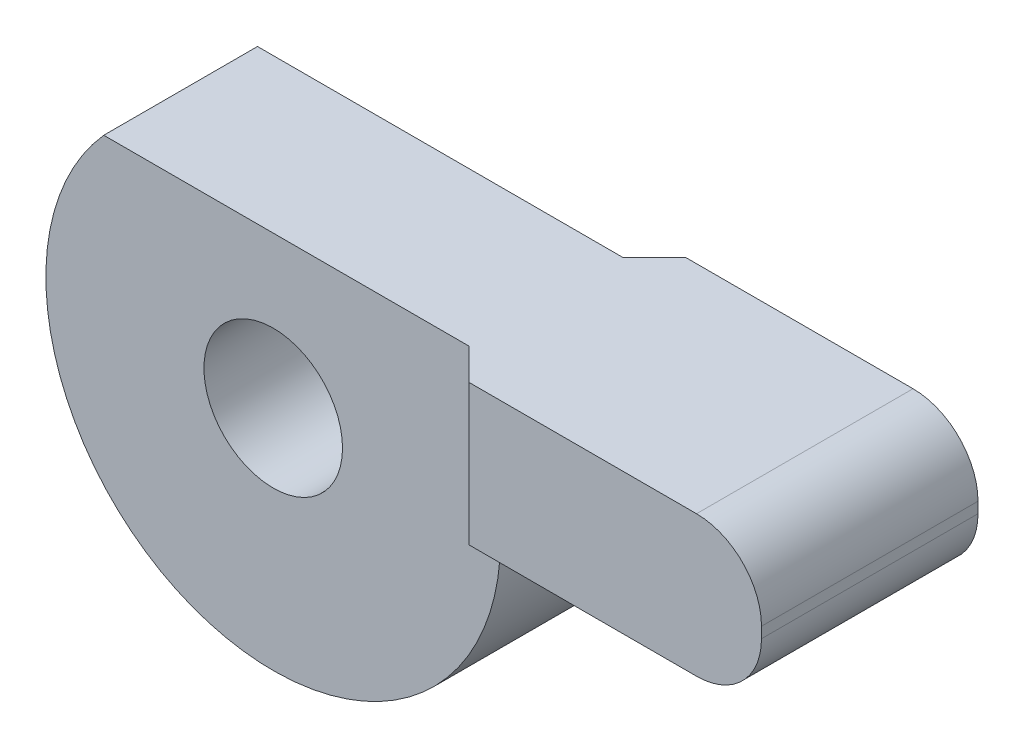
ISO-10303-21;
HEADER;
FILE_DESCRIPTION(('STEP AP214'),'2;1');
FILE_NAME('part.step','',(''),(''),'','','');
FILE_SCHEMA(('AUTOMOTIVE_DESIGN { 1 0 10303 214 1 1 1 1 }'));
ENDSEC;
DATA;
#1=APPLICATION_CONTEXT('core data for automotive mechanical design processes');
#2=APPLICATION_PROTOCOL_DEFINITION('international standard','automotive_design',2000,#1);
#3=PRODUCT_CONTEXT('',#1,'mechanical');
#4=PRODUCT('Part','Part','',(#3));
#5=PRODUCT_RELATED_PRODUCT_CATEGORY('part','',(#4));
#6=PRODUCT_DEFINITION_FORMATION('','',#4);
#7=PRODUCT_DEFINITION_CONTEXT('part definition',#1,'design');
#8=PRODUCT_DEFINITION('design','',#6,#7);
#9=PRODUCT_DEFINITION_SHAPE('','',#8);
#10=(LENGTH_UNIT() NAMED_UNIT(*) SI_UNIT(.MILLI.,.METRE.));
#11=(NAMED_UNIT(*) PLANE_ANGLE_UNIT() SI_UNIT($,.RADIAN.));
#12=(NAMED_UNIT(*) SI_UNIT($,.STERADIAN.) SOLID_ANGLE_UNIT());
#13=UNCERTAINTY_MEASURE_WITH_UNIT(LENGTH_MEASURE(1.E-05),#10,'distance_accuracy_value','');
#14=(GEOMETRIC_REPRESENTATION_CONTEXT(3) GLOBAL_UNCERTAINTY_ASSIGNED_CONTEXT((#13)) GLOBAL_UNIT_ASSIGNED_CONTEXT((#10,
#11,#12)) REPRESENTATION_CONTEXT('',''));
#15=CARTESIAN_POINT('',(0.,0.,0.));
#16=DIRECTION('',(0.,0.,1.));
#17=DIRECTION('',(1.,0.,0.));
#18=AXIS2_PLACEMENT_3D('',#15,#16,#17);
#19=CARTESIAN_POINT('',(2.4,0.7,0.355));
#20=DIRECTION('',(1.,0.,0.));
#21=DIRECTION('',(0.,0.,-1.));
#22=AXIS2_PLACEMENT_3D('',#19,#20,#21);
#23=PLANE('',#22);
#24=DIRECTION('',(0.,1.,0.));
#25=VECTOR('',#24,1.);
#26=CARTESIAN_POINT('',(2.4,0.0500000000000063,-0.5));
#27=LINE('',#26,#25);
#28=CARTESIAN_POINT('',(2.4,0.350000000000007,-0.5));
#29=VERTEX_POINT('',#28);
#30=CARTESIAN_POINT('',(2.4,0.400000000000007,-0.5));
#31=VERTEX_POINT('',#30);
#32=EDGE_CURVE('E230',#29,#31,#27,.T.);
#33=ORIENTED_EDGE('',*,*,#32,.T.);
#34=DIRECTION('',(0.,0.,1.));
#35=VECTOR('',#34,1.);
#36=CARTESIAN_POINT('',(2.4,0.400000000000007,0.355));
#37=LINE('',#36,#35);
#38=CARTESIAN_POINT('',(2.4,0.400000000000007,0.5));
#39=VERTEX_POINT('',#38);
#40=EDGE_CURVE('E261',#39,#31,#37,.F.);
#41=ORIENTED_EDGE('',*,*,#40,.F.);
#42=DIRECTION('',(0.,1.,0.));
#43=VECTOR('',#42,1.);
#44=CARTESIAN_POINT('',(2.4,0.0500000000000063,0.5));
#45=LINE('',#44,#43);
#46=CARTESIAN_POINT('',(2.4,0.350000000000007,0.5));
#47=VERTEX_POINT('',#46);
#48=EDGE_CURVE('E219',#39,#47,#45,.F.);
#49=ORIENTED_EDGE('',*,*,#48,.T.);
#50=DIRECTION('',(0.,0.,1.));
#51=VECTOR('',#50,1.);
#52=CARTESIAN_POINT('',(2.4,0.350000000000007,0.355));
#53=LINE('',#52,#51);
#54=EDGE_CURVE('E258',#29,#47,#53,.T.);
#55=ORIENTED_EDGE('',*,*,#54,.F.);
#56=EDGE_LOOP('',(#33,#41,#49,#55));
#57=FACE_BOUND('',#56,.T.);
#58=ADVANCED_FACE('F16',(#57),#23,.T.);
#59=CARTESIAN_POINT('',(2.1,0.350000000000007,0.355));
#60=DIRECTION('',(0.,0.,1.));
#61=DIRECTION('',(1.,0.,0.));
#62=AXIS2_PLACEMENT_3D('',#59,#60,#61);
#63=CYLINDRICAL_SURFACE('',#62,0.3);
#64=CARTESIAN_POINT('',(2.1,0.350000000000007,-0.5));
#65=DIRECTION('',(0.,0.,1.));
#66=DIRECTION('',(1.,0.,0.));
#67=AXIS2_PLACEMENT_3D('',#64,#65,#66);
#68=CIRCLE('',#67,0.3);
#69=CARTESIAN_POINT('',(2.1,0.0500000000000063,-0.5));
#70=VERTEX_POINT('',#69);
#71=EDGE_CURVE('E19',#70,#29,#68,.T.);
#72=ORIENTED_EDGE('',*,*,#71,.T.);
#73=ORIENTED_EDGE('',*,*,#54,.T.);
#74=CARTESIAN_POINT('',(2.1,0.350000000000007,0.5));
#75=DIRECTION('',(0.,0.,1.));
#76=DIRECTION('',(1.,0.,0.));
#77=AXIS2_PLACEMENT_3D('',#74,#75,#76);
#78=CIRCLE('',#77,0.3);
#79=CARTESIAN_POINT('',(2.1,0.0500000000000063,0.5));
#80=VERTEX_POINT('',#79);
#81=EDGE_CURVE('E221',#47,#80,#78,.F.);
#82=ORIENTED_EDGE('',*,*,#81,.T.);
#83=DIRECTION('',(0.,0.,-1.));
#84=VECTOR('',#83,1.);
#85=CARTESIAN_POINT('',(2.1,0.0500000000000063,0.355));
#86=LINE('',#85,#84);
#87=EDGE_CURVE('E238',#70,#80,#86,.F.);
#88=ORIENTED_EDGE('',*,*,#87,.F.);
#89=EDGE_LOOP('',(#72,#73,#82,#88));
#90=FACE_BOUND('',#89,.T.);
#91=ADVANCED_FACE('F286',(#90),#63,.T.);
#92=CARTESIAN_POINT('',(2.1,0.400000000000007,0.355));
#93=DIRECTION('',(0.,0.,1.));
#94=DIRECTION('',(1.,0.,0.));
#95=AXIS2_PLACEMENT_3D('',#92,#93,#94);
#96=CYLINDRICAL_SURFACE('',#95,0.3);
#97=CARTESIAN_POINT('',(2.1,0.400000000000007,-0.5));
#98=DIRECTION('',(0.,0.,1.));
#99=DIRECTION('',(1.,0.,0.));
#100=AXIS2_PLACEMENT_3D('',#97,#98,#99);
#101=CIRCLE('',#100,0.3);
#102=CARTESIAN_POINT('',(2.1,0.7,-0.5));
#103=VERTEX_POINT('',#102);
#104=EDGE_CURVE('E232',#31,#103,#101,.T.);
#105=ORIENTED_EDGE('',*,*,#104,.T.);
#106=DIRECTION('',(0.,0.,1.));
#107=VECTOR('',#106,1.);
#108=CARTESIAN_POINT('',(2.1,0.7,0.355));
#109=LINE('',#108,#107);
#110=CARTESIAN_POINT('',(2.1,0.7,0.5));
#111=VERTEX_POINT('',#110);
#112=EDGE_CURVE('E213',#111,#103,#109,.F.);
#113=ORIENTED_EDGE('',*,*,#112,.F.);
#114=CARTESIAN_POINT('',(2.1,0.400000000000007,0.5));
#115=DIRECTION('',(0.,0.,1.));
#116=DIRECTION('',(1.,0.,0.));
#117=AXIS2_PLACEMENT_3D('',#114,#115,#116);
#118=CIRCLE('',#117,0.3);
#119=EDGE_CURVE('E222',#111,#39,#118,.F.);
#120=ORIENTED_EDGE('',*,*,#119,.T.);
#121=ORIENTED_EDGE('',*,*,#40,.T.);
#122=EDGE_LOOP('',(#105,#113,#120,#121));
#123=FACE_BOUND('',#122,.T.);
#124=ADVANCED_FACE('F274',(#123),#96,.T.);
#125=CARTESIAN_POINT('',(1.05,0.0500000000000063,-0.5));
#126=DIRECTION('',(0.,0.,1.));
#127=DIRECTION('',(1.,0.,0.));
#128=AXIS2_PLACEMENT_3D('',#125,#126,#127);
#129=PLANE('',#128);
#130=DIRECTION('',(0.,1.,0.));
#131=VECTOR('',#130,1.);
#132=CARTESIAN_POINT('',(1.05,0.0500000000000063,-0.5));
#133=LINE('',#132,#131);
#134=CARTESIAN_POINT('',(1.05,0.150000000000007,-0.5));
#135=VERTEX_POINT('',#134);
#136=CARTESIAN_POINT('',(1.05,0.0500000000000063,-0.5));
#137=VERTEX_POINT('',#136);
#138=EDGE_CURVE('E82',#135,#137,#133,.F.);
#139=ORIENTED_EDGE('',*,*,#138,.F.);
#140=DIRECTION('',(0.,1.,0.));
#141=VECTOR('',#140,1.);
#142=CARTESIAN_POINT('',(1.05,0.150000000000007,-0.5));
#143=LINE('',#142,#141);
#144=CARTESIAN_POINT('',(1.05,0.7,-0.5));
#145=VERTEX_POINT('',#144);
#146=EDGE_CURVE('E185',#135,#145,#143,.T.);
#147=ORIENTED_EDGE('',*,*,#146,.T.);
#148=DIRECTION('',(1.,0.,0.));
#149=VECTOR('',#148,1.);
#150=CARTESIAN_POINT('',(-0.782623792124914,0.7,-0.5));
#151=LINE('',#150,#149);
#152=EDGE_CURVE('E205',#103,#145,#151,.F.);
#153=ORIENTED_EDGE('',*,*,#152,.F.);
#154=ORIENTED_EDGE('',*,*,#104,.F.);
#155=ORIENTED_EDGE('',*,*,#32,.F.);
#156=ORIENTED_EDGE('',*,*,#71,.F.);
#157=DIRECTION('',(1.,0.,0.));
#158=VECTOR('',#157,1.);
#159=CARTESIAN_POINT('',(2.4,0.0500000000000063,-0.5));
#160=LINE('',#159,#158);
#161=EDGE_CURVE('E184',#137,#70,#160,.T.);
#162=ORIENTED_EDGE('',*,*,#161,.F.);
#163=EDGE_LOOP('',(#139,#147,#153,#154,#155,#156,#162));
#164=FACE_BOUND('',#163,.T.);
#165=ADVANCED_FACE('F275',(#164),#129,.F.);
#166=CARTESIAN_POINT('',(1.05,0.0500000000000063,0.5));
#167=DIRECTION('',(0.,0.,-1.));
#168=DIRECTION('',(-1.,0.,0.));
#169=AXIS2_PLACEMENT_3D('',#166,#167,#168);
#170=PLANE('',#169);
#171=ORIENTED_EDGE('',*,*,#81,.F.);
#172=ORIENTED_EDGE('',*,*,#48,.F.);
#173=ORIENTED_EDGE('',*,*,#119,.F.);
#174=DIRECTION('',(1.,0.,0.));
#175=VECTOR('',#174,1.);
#176=CARTESIAN_POINT('',(-0.782623792124914,0.7,0.5));
#177=LINE('',#176,#175);
#178=CARTESIAN_POINT('',(1.05,0.7,0.5));
#179=VERTEX_POINT('',#178);
#180=EDGE_CURVE('E166',#179,#111,#177,.T.);
#181=ORIENTED_EDGE('',*,*,#180,.F.);
#182=DIRECTION('',(0.,1.,0.));
#183=VECTOR('',#182,1.);
#184=CARTESIAN_POINT('',(1.05,0.150000000000007,0.5));
#185=LINE('',#184,#183);
#186=CARTESIAN_POINT('',(1.05,0.150000000000007,0.5));
#187=VERTEX_POINT('',#186);
#188=EDGE_CURVE('E135',#179,#187,#185,.F.);
#189=ORIENTED_EDGE('',*,*,#188,.T.);
#190=DIRECTION('',(0.,1.,0.));
#191=VECTOR('',#190,1.);
#192=CARTESIAN_POINT('',(1.05,0.0500000000000063,0.5));
#193=LINE('',#192,#191);
#194=CARTESIAN_POINT('',(1.05,0.0500000000000063,0.5));
#195=VERTEX_POINT('',#194);
#196=EDGE_CURVE('E172',#195,#187,#193,.T.);
#197=ORIENTED_EDGE('',*,*,#196,.F.);
#198=DIRECTION('',(1.,0.,0.));
#199=VECTOR('',#198,1.);
#200=CARTESIAN_POINT('',(2.4,0.0500000000000063,0.5));
#201=LINE('',#200,#199);
#202=EDGE_CURVE('E235',#80,#195,#201,.F.);
#203=ORIENTED_EDGE('',*,*,#202,.F.);
#204=EDGE_LOOP('',(#171,#172,#173,#181,#189,#197,#203));
#205=FACE_BOUND('',#204,.T.);
#206=ADVANCED_FACE('F280',(#205),#170,.F.);
#207=CARTESIAN_POINT('',(1.05,0.0500000000000063,-0.5));
#208=DIRECTION('',(-1.,0.,0.));
#209=DIRECTION('',(0.,0.,1.));
#210=AXIS2_PLACEMENT_3D('',#207,#208,#209);
#211=PLANE('',#210);
#212=DIRECTION('',(0.,1.,0.));
#213=VECTOR('',#212,1.);
#214=CARTESIAN_POINT('',(1.05,0.,-0.355));
#215=LINE('',#214,#213);
#216=CARTESIAN_POINT('',(1.05,0.0500000000000063,-0.355));
#217=VERTEX_POINT('',#216);
#218=CARTESIAN_POINT('',(1.05,0.150000000000007,-0.355));
#219=VERTEX_POINT('',#218);
#220=EDGE_CURVE('E188',#217,#219,#215,.T.);
#221=ORIENTED_EDGE('',*,*,#220,.T.);
#222=DIRECTION('',(0.,0.,1.));
#223=VECTOR('',#222,1.);
#224=CARTESIAN_POINT('',(1.05,0.150000000000007,-0.355));
#225=LINE('',#224,#223);
#226=EDGE_CURVE('E194',#219,#135,#225,.F.);
#227=ORIENTED_EDGE('',*,*,#226,.T.);
#228=ORIENTED_EDGE('',*,*,#138,.T.);
#229=DIRECTION('',(0.,0.,-1.));
#230=VECTOR('',#229,1.);
#231=CARTESIAN_POINT('',(1.05,0.0500000000000063,0.355));
#232=LINE('',#231,#230);
#233=EDGE_CURVE('E181',#217,#137,#232,.T.);
#234=ORIENTED_EDGE('',*,*,#233,.F.);
#235=EDGE_LOOP('',(#221,#227,#228,#234));
#236=FACE_BOUND('',#235,.T.);
#237=ADVANCED_FACE('F291',(#236),#211,.T.);
#238=CARTESIAN_POINT('',(1.05,0.150000000000007,-0.355));
#239=DIRECTION('',(0.,1.,0.));
#240=DIRECTION('',(0.,0.,1.));
#241=AXIS2_PLACEMENT_3D('',#238,#239,#240);
#242=PLANE('',#241);
#243=DIRECTION('',(1.,0.,0.));
#244=VECTOR('',#243,1.);
#245=CARTESIAN_POINT('',(0.,0.150000000000007,-0.355));
#246=LINE('',#245,#244);
#247=CARTESIAN_POINT('',(0.905,0.150000000000007,-0.355));
#248=VERTEX_POINT('',#247);
#249=EDGE_CURVE('E190',#219,#248,#246,.F.);
#250=ORIENTED_EDGE('',*,*,#249,.T.);
#251=DIRECTION('',(0.707106781186547,0.,-0.707106781186548));
#252=VECTOR('',#251,1.);
#253=CARTESIAN_POINT('',(1.05,0.150000000000007,-0.5));
#254=LINE('',#253,#252);
#255=EDGE_CURVE('E196',#248,#135,#254,.T.);
#256=ORIENTED_EDGE('',*,*,#255,.T.);
#257=ORIENTED_EDGE('',*,*,#226,.F.);
#258=EDGE_LOOP('',(#250,#256,#257));
#259=FACE_BOUND('',#258,.T.);
#260=ADVANCED_FACE('F296',(#259),#242,.F.);
#261=CARTESIAN_POINT('',(1.05,0.150000000000007,-0.5));
#262=DIRECTION('',(0.707106781186548,0.,0.707106781186547));
#263=DIRECTION('',(0.707106781186547,0.,-0.707106781186548));
#264=AXIS2_PLACEMENT_3D('',#261,#262,#263);
#265=PLANE('',#264);
#266=ORIENTED_EDGE('',*,*,#146,.F.);
#267=ORIENTED_EDGE('',*,*,#255,.F.);
#268=DIRECTION('',(0.,1.,0.));
#269=VECTOR('',#268,1.);
#270=CARTESIAN_POINT('',(0.905,0.,-0.355));
#271=LINE('',#270,#269);
#272=CARTESIAN_POINT('',(0.905,0.7,-0.355));
#273=VERTEX_POINT('',#272);
#274=EDGE_CURVE('E200',#248,#273,#271,.T.);
#275=ORIENTED_EDGE('',*,*,#274,.T.);
#276=DIRECTION('',(-0.707106781186548,0.,0.707106781186547));
#277=VECTOR('',#276,1.);
#278=CARTESIAN_POINT('',(1.05,0.7,-0.5));
#279=LINE('',#278,#277);
#280=EDGE_CURVE('E203',#145,#273,#279,.T.);
#281=ORIENTED_EDGE('',*,*,#280,.F.);
#282=EDGE_LOOP('',(#266,#267,#275,#281));
#283=FACE_BOUND('',#282,.T.);
#284=ADVANCED_FACE('F299',(#283),#265,.F.);
#285=CARTESIAN_POINT('',(2.4,0.0500000000000063,0.355));
#286=DIRECTION('',(0.,-1.,0.));
#287=DIRECTION('',(0.,0.,-1.));
#288=AXIS2_PLACEMENT_3D('',#285,#286,#287);
#289=PLANE('',#288);
#290=ORIENTED_EDGE('',*,*,#202,.T.);
#291=DIRECTION('',(0.,0.,1.));
#292=VECTOR('',#291,1.);
#293=CARTESIAN_POINT('',(1.05,0.0500000000000063,0.5));
#294=LINE('',#293,#292);
#295=CARTESIAN_POINT('',(1.05,0.0500000000000063,0.355));
#296=VERTEX_POINT('',#295);
#297=EDGE_CURVE('E163',#296,#195,#294,.T.);
#298=ORIENTED_EDGE('',*,*,#297,.F.);
#299=DIRECTION('',(0.,0.,-1.));
#300=VECTOR('',#299,1.);
#301=CARTESIAN_POINT('',(1.05,0.0500000000000063,0.355));
#302=LINE('',#301,#300);
#303=EDGE_CURVE('E152',#217,#296,#302,.F.);
#304=ORIENTED_EDGE('',*,*,#303,.F.);
#305=ORIENTED_EDGE('',*,*,#233,.T.);
#306=ORIENTED_EDGE('',*,*,#161,.T.);
#307=ORIENTED_EDGE('',*,*,#87,.T.);
#308=EDGE_LOOP('',(#290,#298,#304,#305,#306,#307));
#309=FACE_BOUND('',#308,.T.);
#310=ADVANCED_FACE('F288',(#309),#289,.T.);
#311=CARTESIAN_POINT('',(0.,0.,0.355));
#312=DIRECTION('',(0.,0.,1.));
#313=DIRECTION('',(1.,0.,0.));
#314=AXIS2_PLACEMENT_3D('',#311,#312,#313);
#315=CYLINDRICAL_SURFACE('',#314,0.32);
#316=CARTESIAN_POINT('',(0.,0.,-0.355));
#317=DIRECTION('',(0.,0.,1.));
#318=DIRECTION('',(1.,0.,0.));
#319=AXIS2_PLACEMENT_3D('',#316,#317,#318);
#320=CIRCLE('',#319,0.32);
#321=CARTESIAN_POINT('',(0.320000000000003,0.,-0.355));
#322=VERTEX_POINT('',#321);
#323=EDGE_CURVE('E136',#322,#322,#320,.F.);
#324=ORIENTED_EDGE('',*,*,#323,.T.);
#325=EDGE_LOOP('',(#324));
#326=FACE_BOUND('',#325,.T.);
#327=CARTESIAN_POINT('',(0.,0.,0.355));
#328=DIRECTION('',(0.,0.,1.));
#329=DIRECTION('',(1.,0.,0.));
#330=AXIS2_PLACEMENT_3D('',#327,#328,#329);
#331=CIRCLE('',#330,0.32);
#332=CARTESIAN_POINT('',(0.320000000000003,0.,0.355));
#333=VERTEX_POINT('',#332);
#334=EDGE_CURVE('E154',#333,#333,#331,.T.);
#335=ORIENTED_EDGE('',*,*,#334,.T.);
#336=EDGE_LOOP('',(#335));
#337=FACE_BOUND('',#336,.T.);
#338=ADVANCED_FACE('F328',(#326,#337),#315,.F.);
#339=CARTESIAN_POINT('',(1.05,0.150000000000007,0.355));
#340=DIRECTION('',(0.,1.,0.));
#341=DIRECTION('',(0.,0.,1.));
#342=AXIS2_PLACEMENT_3D('',#339,#340,#341);
#343=PLANE('',#342);
#344=DIRECTION('',(-0.707106781186547,0.,-0.707106781186548));
#345=VECTOR('',#344,1.);
#346=CARTESIAN_POINT('',(1.05,0.150000000000007,0.5));
#347=LINE('',#346,#345);
#348=CARTESIAN_POINT('',(0.905,0.150000000000007,0.355));
#349=VERTEX_POINT('',#348);
#350=EDGE_CURVE('E137',#187,#349,#347,.T.);
#351=ORIENTED_EDGE('',*,*,#350,.T.);
#352=DIRECTION('',(-1.,0.,0.));
#353=VECTOR('',#352,1.);
#354=CARTESIAN_POINT('',(0.,0.150000000000007,0.355));
#355=LINE('',#354,#353);
#356=CARTESIAN_POINT('',(1.05,0.150000000000007,0.355));
#357=VERTEX_POINT('',#356);
#358=EDGE_CURVE('E142',#349,#357,#355,.F.);
#359=ORIENTED_EDGE('',*,*,#358,.T.);
#360=DIRECTION('',(0.,0.,1.));
#361=VECTOR('',#360,1.);
#362=CARTESIAN_POINT('',(1.05,0.150000000000007,0.5));
#363=LINE('',#362,#361);
#364=EDGE_CURVE('E167',#187,#357,#363,.F.);
#365=ORIENTED_EDGE('',*,*,#364,.F.);
#366=EDGE_LOOP('',(#351,#359,#365));
#367=FACE_BOUND('',#366,.T.);
#368=ADVANCED_FACE('F326',(#367),#343,.F.);
#369=CARTESIAN_POINT('',(1.05,0.0500000000000063,0.5));
#370=DIRECTION('',(-1.,0.,0.));
#371=DIRECTION('',(0.,0.,1.));
#372=AXIS2_PLACEMENT_3D('',#369,#370,#371);
#373=PLANE('',#372);
#374=DIRECTION('',(0.,1.,0.));
#375=VECTOR('',#374,1.);
#376=CARTESIAN_POINT('',(1.05,0.,0.355));
#377=LINE('',#376,#375);
#378=EDGE_CURVE('E158',#357,#296,#377,.F.);
#379=ORIENTED_EDGE('',*,*,#378,.T.);
#380=ORIENTED_EDGE('',*,*,#297,.T.);
#381=ORIENTED_EDGE('',*,*,#196,.T.);
#382=ORIENTED_EDGE('',*,*,#364,.T.);
#383=EDGE_LOOP('',(#379,#380,#381,#382));
#384=FACE_BOUND('',#383,.T.);
#385=ADVANCED_FACE('F324',(#384),#373,.T.);
#386=CARTESIAN_POINT('',(-0.782623792124914,0.7,0.355));
#387=DIRECTION('',(0.,1.,0.));
#388=DIRECTION('',(0.,0.,1.));
#389=AXIS2_PLACEMENT_3D('',#386,#387,#388);
#390=PLANE('',#389);
#391=DIRECTION('',(-1.,0.,0.));
#392=VECTOR('',#391,1.);
#393=CARTESIAN_POINT('',(0.,0.7,0.355));
#394=LINE('',#393,#392);
#395=CARTESIAN_POINT('',(-0.782623792124919,0.7,0.355));
#396=VERTEX_POINT('',#395);
#397=CARTESIAN_POINT('',(0.905,0.7,0.355));
#398=VERTEX_POINT('',#397);
#399=EDGE_CURVE('E117',#396,#398,#394,.F.);
#400=ORIENTED_EDGE('',*,*,#399,.T.);
#401=DIRECTION('',(-0.707106781186547,0.,-0.707106781186548));
#402=VECTOR('',#401,1.);
#403=CARTESIAN_POINT('',(1.05,0.7,0.5));
#404=LINE('',#403,#402);
#405=EDGE_CURVE('E121',#398,#179,#404,.F.);
#406=ORIENTED_EDGE('',*,*,#405,.T.);
#407=ORIENTED_EDGE('',*,*,#180,.T.);
#408=ORIENTED_EDGE('',*,*,#112,.T.);
#409=ORIENTED_EDGE('',*,*,#152,.T.);
#410=ORIENTED_EDGE('',*,*,#280,.T.);
#411=DIRECTION('',(1.,0.,0.));
#412=VECTOR('',#411,1.);
#413=CARTESIAN_POINT('',(0.,0.7,-0.355));
#414=LINE('',#413,#412);
#415=CARTESIAN_POINT('',(-0.782623792124919,0.7,-0.355));
#416=VERTEX_POINT('',#415);
#417=EDGE_CURVE('E191',#273,#416,#414,.F.);
#418=ORIENTED_EDGE('',*,*,#417,.T.);
#419=DIRECTION('',(0.,0.,1.));
#420=VECTOR('',#419,1.);
#421=CARTESIAN_POINT('',(-0.782623792124914,0.7,0.355));
#422=LINE('',#421,#420);
#423=EDGE_CURVE('E124',#416,#396,#422,.T.);
#424=ORIENTED_EDGE('',*,*,#423,.T.);
#425=EDGE_LOOP('',(#400,#406,#407,#408,#409,#410,#418,#424));
#426=FACE_BOUND('',#425,.T.);
#427=ADVANCED_FACE('F119',(#426),#390,.T.);
#428=CARTESIAN_POINT('',(1.05,0.150000000000007,0.5));
#429=DIRECTION('',(0.707106781186548,0.,-0.707106781186547));
#430=DIRECTION('',(-0.707106781186547,0.,-0.707106781186548));
#431=AXIS2_PLACEMENT_3D('',#428,#429,#430);
#432=PLANE('',#431);
#433=DIRECTION('',(0.,1.,0.));
#434=VECTOR('',#433,1.);
#435=CARTESIAN_POINT('',(0.905,0.,0.355));
#436=LINE('',#435,#434);
#437=EDGE_CURVE('E127',#398,#349,#436,.F.);
#438=ORIENTED_EDGE('',*,*,#437,.T.);
#439=ORIENTED_EDGE('',*,*,#350,.F.);
#440=ORIENTED_EDGE('',*,*,#188,.F.);
#441=ORIENTED_EDGE('',*,*,#405,.F.);
#442=EDGE_LOOP('',(#438,#439,#440,#441));
#443=FACE_BOUND('',#442,.T.);
#444=ADVANCED_FACE('F131',(#443),#432,.F.);
#445=CARTESIAN_POINT('',(0.,0.,-0.355));
#446=DIRECTION('',(0.,0.,1.));
#447=DIRECTION('',(1.,0.,0.));
#448=AXIS2_PLACEMENT_3D('',#445,#446,#447);
#449=PLANE('',#448);
#450=ORIENTED_EDGE('',*,*,#249,.F.);
#451=ORIENTED_EDGE('',*,*,#220,.F.);
#452=DIRECTION('',(0.,1.,0.));
#453=VECTOR('',#452,1.);
#454=CARTESIAN_POINT('',(1.05,0.,-0.355));
#455=LINE('',#454,#453);
#456=CARTESIAN_POINT('',(1.05,0.,-0.355));
#457=VERTEX_POINT('',#456);
#458=EDGE_CURVE('E155',#457,#217,#455,.T.);
#459=ORIENTED_EDGE('',*,*,#458,.F.);
#460=CARTESIAN_POINT('',(0.,0.,-0.355));
#461=DIRECTION('',(0.,0.,1.));
#462=DIRECTION('',(1.,0.,0.));
#463=AXIS2_PLACEMENT_3D('',#460,#461,#462);
#464=CIRCLE('',#463,1.05);
#465=EDGE_CURVE('E143',#416,#457,#464,.T.);
#466=ORIENTED_EDGE('',*,*,#465,.F.);
#467=ORIENTED_EDGE('',*,*,#417,.F.);
#468=ORIENTED_EDGE('',*,*,#274,.F.);
#469=EDGE_LOOP('',(#450,#451,#459,#466,#467,#468));
#470=FACE_BOUND('',#469,.T.);
#471=ORIENTED_EDGE('',*,*,#323,.F.);
#472=EDGE_LOOP('',(#471));
#473=FACE_BOUND('',#472,.T.);
#474=ADVANCED_FACE('F304',(#470,#473),#449,.F.);
#475=CARTESIAN_POINT('',(1.05,0.,0.355));
#476=DIRECTION('',(1.,0.,0.));
#477=DIRECTION('',(0.,0.,-1.));
#478=AXIS2_PLACEMENT_3D('',#475,#476,#477);
#479=PLANE('',#478);
#480=ORIENTED_EDGE('',*,*,#303,.T.);
#481=DIRECTION('',(0.,1.,0.));
#482=VECTOR('',#481,1.);
#483=CARTESIAN_POINT('',(1.05,0.,0.355));
#484=LINE('',#483,#482);
#485=CARTESIAN_POINT('',(1.05,0.,0.355));
#486=VERTEX_POINT('',#485);
#487=EDGE_CURVE('E34',#296,#486,#484,.F.);
#488=ORIENTED_EDGE('',*,*,#487,.T.);
#489=DIRECTION('',(0.,0.,1.));
#490=VECTOR('',#489,1.);
#491=CARTESIAN_POINT('',(1.05,0.,0.355));
#492=LINE('',#491,#490);
#493=EDGE_CURVE('E25',#457,#486,#492,.T.);
#494=ORIENTED_EDGE('',*,*,#493,.F.);
#495=ORIENTED_EDGE('',*,*,#458,.T.);
#496=EDGE_LOOP('',(#480,#488,#494,#495));
#497=FACE_BOUND('',#496,.T.);
#498=ADVANCED_FACE('F322',(#497),#479,.T.);
#499=CARTESIAN_POINT('',(0.,0.,0.355));
#500=DIRECTION('',(0.,0.,-1.));
#501=DIRECTION('',(-1.,0.,0.));
#502=AXIS2_PLACEMENT_3D('',#499,#500,#501);
#503=PLANE('',#502);
#504=ORIENTED_EDGE('',*,*,#399,.F.);
#505=CARTESIAN_POINT('',(0.,0.,0.355));
#506=DIRECTION('',(0.,0.,1.));
#507=DIRECTION('',(1.,0.,0.));
#508=AXIS2_PLACEMENT_3D('',#505,#506,#507);
#509=CIRCLE('',#508,1.05);
#510=EDGE_CURVE('E11',#486,#396,#509,.F.);
#511=ORIENTED_EDGE('',*,*,#510,.F.);
#512=ORIENTED_EDGE('',*,*,#487,.F.);
#513=ORIENTED_EDGE('',*,*,#378,.F.);
#514=ORIENTED_EDGE('',*,*,#358,.F.);
#515=ORIENTED_EDGE('',*,*,#437,.F.);
#516=EDGE_LOOP('',(#504,#511,#512,#513,#514,#515));
#517=FACE_BOUND('',#516,.T.);
#518=ORIENTED_EDGE('',*,*,#334,.F.);
#519=EDGE_LOOP('',(#518));
#520=FACE_BOUND('',#519,.T.);
#521=ADVANCED_FACE('F139',(#517,#520),#503,.F.);
#522=CARTESIAN_POINT('',(0.,0.,0.355));
#523=DIRECTION('',(0.,0.,1.));
#524=DIRECTION('',(1.,0.,0.));
#525=AXIS2_PLACEMENT_3D('',#522,#523,#524);
#526=CYLINDRICAL_SURFACE('',#525,1.05);
#527=ORIENTED_EDGE('',*,*,#493,.T.);
#528=ORIENTED_EDGE('',*,*,#510,.T.);
#529=ORIENTED_EDGE('',*,*,#423,.F.);
#530=ORIENTED_EDGE('',*,*,#465,.T.);
#531=EDGE_LOOP('',(#527,#528,#529,#530));
#532=FACE_BOUND('',#531,.T.);
#533=ADVANCED_FACE('F309',(#532),#526,.T.);
#534=CLOSED_SHELL('',(#58,#91,#124,#165,#206,#237,#260,#284,#310,#338,#368,#385,#427,#444,#474,
#498,#521,#533));
#535=MANIFOLD_SOLID_BREP('B1',#534);
#536=ADVANCED_BREP_SHAPE_REPRESENTATION('',(#18,#535),#14);
#537=SHAPE_DEFINITION_REPRESENTATION(#9,#536);
ENDSEC;
END-ISO-10303-21;
